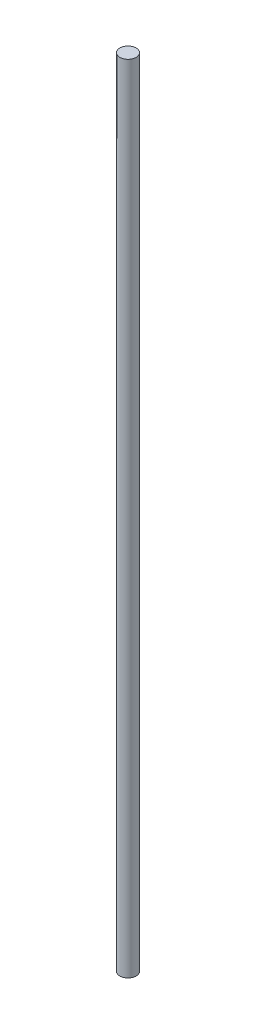
ISO-10303-21;
HEADER;
FILE_DESCRIPTION(('STEP AP214'),'2;1');
FILE_NAME('part.step','',(''),(''),'','','');
FILE_SCHEMA(('AUTOMOTIVE_DESIGN { 1 0 10303 214 1 1 1 1 }'));
ENDSEC;
DATA;
#1=APPLICATION_CONTEXT('core data for automotive mechanical design processes');
#2=APPLICATION_PROTOCOL_DEFINITION('international standard','automotive_design',2000,#1);
#3=PRODUCT_CONTEXT('',#1,'mechanical');
#4=PRODUCT('Part','Part','',(#3));
#5=PRODUCT_RELATED_PRODUCT_CATEGORY('part','',(#4));
#6=PRODUCT_DEFINITION_FORMATION('','',#4);
#7=PRODUCT_DEFINITION_CONTEXT('part definition',#1,'design');
#8=PRODUCT_DEFINITION('design','',#6,#7);
#9=PRODUCT_DEFINITION_SHAPE('','',#8);
#10=(LENGTH_UNIT() NAMED_UNIT(*) SI_UNIT(.MILLI.,.METRE.));
#11=(NAMED_UNIT(*) PLANE_ANGLE_UNIT() SI_UNIT($,.RADIAN.));
#12=(NAMED_UNIT(*) SI_UNIT($,.STERADIAN.) SOLID_ANGLE_UNIT());
#13=UNCERTAINTY_MEASURE_WITH_UNIT(LENGTH_MEASURE(1.E-05),#10,'distance_accuracy_value','');
#14=(GEOMETRIC_REPRESENTATION_CONTEXT(3) GLOBAL_UNCERTAINTY_ASSIGNED_CONTEXT((#13)) GLOBAL_UNIT_ASSIGNED_CONTEXT((#10,
#11,#12)) REPRESENTATION_CONTEXT('',''));
#15=CARTESIAN_POINT('',(0.,0.,0.));
#16=DIRECTION('',(0.,0.,1.));
#17=DIRECTION('',(1.,0.,0.));
#18=AXIS2_PLACEMENT_3D('',#15,#16,#17);
#19=CARTESIAN_POINT('',(0.,195.,0.));
#20=DIRECTION('',(0.,-1.,0.));
#21=DIRECTION('',(0.,0.,-1.));
#22=AXIS2_PLACEMENT_3D('',#19,#20,#21);
#23=CYLINDRICAL_SURFACE('',#22,4.);
#24=CARTESIAN_POINT('',(0.,195.,0.));
#25=DIRECTION('',(0.,-1.,0.));
#26=DIRECTION('',(0.,0.,-1.));
#27=AXIS2_PLACEMENT_3D('',#24,#25,#26);
#28=CIRCLE('',#27,4.);
#29=CARTESIAN_POINT('',(0.,195.,-4.));
#30=VERTEX_POINT('',#29);
#31=EDGE_CURVE('E10',#30,#30,#28,.T.);
#32=ORIENTED_EDGE('',*,*,#31,.T.);
#33=EDGE_LOOP('',(#32));
#34=FACE_BOUND('',#33,.T.);
#35=CARTESIAN_POINT('',(0.,-195.,0.));
#36=DIRECTION('',(0.,-1.,0.));
#37=DIRECTION('',(0.,0.,-1.));
#38=AXIS2_PLACEMENT_3D('',#35,#36,#37);
#39=CIRCLE('',#38,4.);
#40=CARTESIAN_POINT('',(0.,-195.,-4.));
#41=VERTEX_POINT('',#40);
#42=EDGE_CURVE('E41',#41,#41,#39,.T.);
#43=ORIENTED_EDGE('',*,*,#42,.F.);
#44=EDGE_LOOP('',(#43));
#45=FACE_BOUND('',#44,.T.);
#46=ADVANCED_FACE('F35',(#34,#45),#23,.T.);
#47=CARTESIAN_POINT('',(4.,195.,0.));
#48=DIRECTION('',(0.,1.,0.));
#49=DIRECTION('',(0.,0.,1.));
#50=AXIS2_PLACEMENT_3D('',#47,#48,#49);
#51=PLANE('',#50);
#52=ORIENTED_EDGE('',*,*,#31,.F.);
#53=EDGE_LOOP('',(#52));
#54=FACE_BOUND('',#53,.T.);
#55=ADVANCED_FACE('F50',(#54),#51,.T.);
#56=CARTESIAN_POINT('',(0.,-195.,0.));
#57=DIRECTION('',(0.,-1.,0.));
#58=DIRECTION('',(0.,0.,-1.));
#59=AXIS2_PLACEMENT_3D('',#56,#57,#58);
#60=PLANE('',#59);
#61=ORIENTED_EDGE('',*,*,#42,.T.);
#62=EDGE_LOOP('',(#61));
#63=FACE_BOUND('',#62,.T.);
#64=ADVANCED_FACE('F47',(#63),#60,.T.);
#65=CLOSED_SHELL('',(#46,#55,#64));
#66=MANIFOLD_SOLID_BREP('B2',#65);
#67=ADVANCED_BREP_SHAPE_REPRESENTATION('',(#18,#66),#14);
#68=SHAPE_DEFINITION_REPRESENTATION(#9,#67);
ENDSEC;
END-ISO-10303-21;
